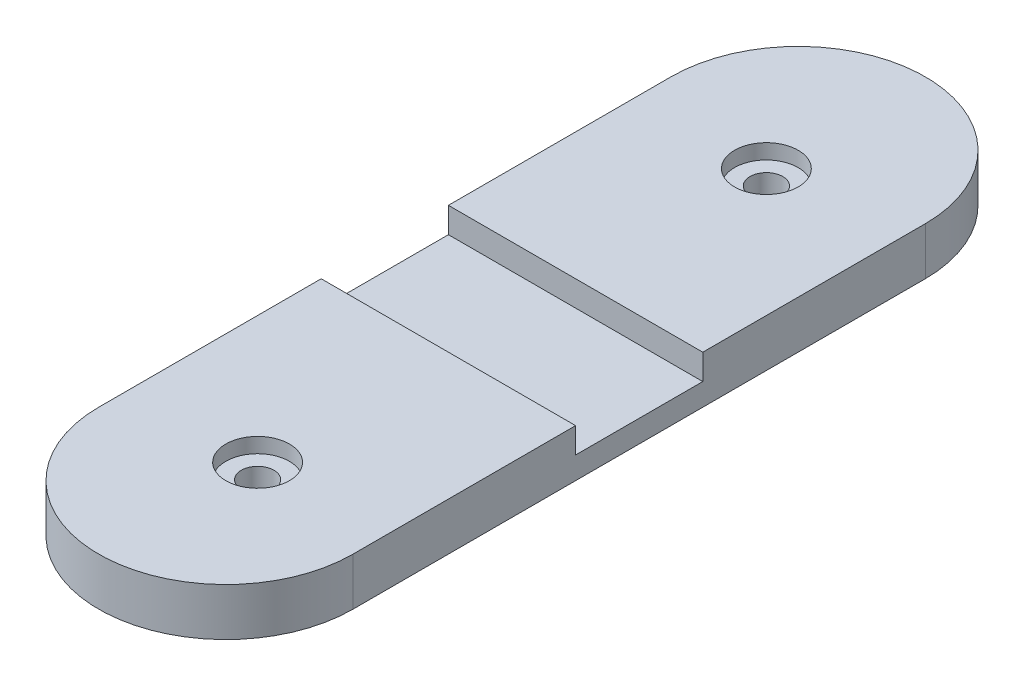
ISO-10303-21;
HEADER;
FILE_DESCRIPTION(('STEP AP214'),'2;1');
FILE_NAME('part.step','',(''),(''),'','','');
FILE_SCHEMA(('AUTOMOTIVE_DESIGN { 1 0 10303 214 1 1 1 1 }'));
ENDSEC;
DATA;
#1=APPLICATION_CONTEXT('core data for automotive mechanical design processes');
#2=APPLICATION_PROTOCOL_DEFINITION('international standard','automotive_design',2000,#1);
#3=PRODUCT_CONTEXT('',#1,'mechanical');
#4=PRODUCT('Part','Part','',(#3));
#5=PRODUCT_RELATED_PRODUCT_CATEGORY('part','',(#4));
#6=PRODUCT_DEFINITION_FORMATION('','',#4);
#7=PRODUCT_DEFINITION_CONTEXT('part definition',#1,'design');
#8=PRODUCT_DEFINITION('design','',#6,#7);
#9=PRODUCT_DEFINITION_SHAPE('','',#8);
#10=(LENGTH_UNIT() NAMED_UNIT(*) SI_UNIT(.MILLI.,.METRE.));
#11=(NAMED_UNIT(*) PLANE_ANGLE_UNIT() SI_UNIT($,.RADIAN.));
#12=(NAMED_UNIT(*) SI_UNIT($,.STERADIAN.) SOLID_ANGLE_UNIT());
#13=UNCERTAINTY_MEASURE_WITH_UNIT(LENGTH_MEASURE(1.E-05),#10,'distance_accuracy_value','');
#14=(GEOMETRIC_REPRESENTATION_CONTEXT(3) GLOBAL_UNCERTAINTY_ASSIGNED_CONTEXT((#13)) GLOBAL_UNIT_ASSIGNED_CONTEXT((#10,
#11,#12)) REPRESENTATION_CONTEXT('',''));
#15=CARTESIAN_POINT('',(0.,0.,0.));
#16=DIRECTION('',(0.,0.,1.));
#17=DIRECTION('',(1.,0.,0.));
#18=AXIS2_PLACEMENT_3D('',#15,#16,#17);
#19=CARTESIAN_POINT('',(0.,4.7625,-28.575));
#20=DIRECTION('',(0.,-1.,0.));
#21=DIRECTION('',(0.,0.,-1.));
#22=AXIS2_PLACEMENT_3D('',#19,#20,#21);
#23=PLANE('',#22);
#24=CARTESIAN_POINT('',(0.,4.7625,-25.4));
#25=DIRECTION('',(0.,1.,0.));
#26=DIRECTION('',(0.,0.,1.));
#27=AXIS2_PLACEMENT_3D('',#24,#25,#26);
#28=CIRCLE('',#27,3.175);
#29=CARTESIAN_POINT('',(0.,4.7625,-22.225));
#30=VERTEX_POINT('',#29);
#31=EDGE_CURVE('E149',#30,#30,#28,.T.);
#32=ORIENTED_EDGE('',*,*,#31,.F.);
#33=EDGE_LOOP('',(#32));
#34=FACE_BOUND('',#33,.T.);
#35=DIRECTION('',(0.,0.,1.));
#36=VECTOR('',#35,1.);
#37=CARTESIAN_POINT('',(-12.7,4.7625,28.575));
#38=LINE('',#37,#36);
#39=CARTESIAN_POINT('',(-12.7,4.7625,-28.575));
#40=VERTEX_POINT('',#39);
#41=CARTESIAN_POINT('',(-12.7,4.7625,-6.35));
#42=VERTEX_POINT('',#41);
#43=EDGE_CURVE('E88',#40,#42,#38,.T.);
#44=ORIENTED_EDGE('',*,*,#43,.T.);
#45=DIRECTION('',(-1.,0.,0.));
#46=VECTOR('',#45,1.);
#47=CARTESIAN_POINT('',(12.7,4.7625,-6.35));
#48=LINE('',#47,#46);
#49=CARTESIAN_POINT('',(12.7,4.7625,-6.35));
#50=VERTEX_POINT('',#49);
#51=EDGE_CURVE('E124',#50,#42,#48,.T.);
#52=ORIENTED_EDGE('',*,*,#51,.F.);
#53=DIRECTION('',(0.,0.,-1.));
#54=VECTOR('',#53,1.);
#55=CARTESIAN_POINT('',(12.7,4.7625,-28.575));
#56=LINE('',#55,#54);
#57=CARTESIAN_POINT('',(12.7,4.7625,-28.575));
#58=VERTEX_POINT('',#57);
#59=EDGE_CURVE('E59',#50,#58,#56,.T.);
#60=ORIENTED_EDGE('',*,*,#59,.T.);
#61=CARTESIAN_POINT('',(0.,4.7625,-28.575));
#62=DIRECTION('',(0.,1.,0.));
#63=DIRECTION('',(0.,0.,-1.));
#64=AXIS2_PLACEMENT_3D('',#61,#62,#63);
#65=CIRCLE('',#64,12.7);
#66=EDGE_CURVE('E162',#58,#40,#65,.T.);
#67=ORIENTED_EDGE('',*,*,#66,.T.);
#68=EDGE_LOOP('',(#44,#52,#60,#67));
#69=FACE_BOUND('',#68,.T.);
#70=ADVANCED_FACE('F35',(#34,#69),#23,.F.);
#71=CARTESIAN_POINT('',(0.,4.7625,-28.575));
#72=DIRECTION('',(0.,-1.,0.));
#73=DIRECTION('',(0.,0.,-1.));
#74=AXIS2_PLACEMENT_3D('',#71,#72,#73);
#75=CYLINDRICAL_SURFACE('',#74,12.7);
#76=CARTESIAN_POINT('',(0.,0.,-28.575));
#77=DIRECTION('',(0.,1.,0.));
#78=DIRECTION('',(0.,0.,-1.));
#79=AXIS2_PLACEMENT_3D('',#76,#77,#78);
#80=CIRCLE('',#79,12.7);
#81=CARTESIAN_POINT('',(12.7,0.,-28.575));
#82=VERTEX_POINT('',#81);
#83=CARTESIAN_POINT('',(-12.7,0.,-28.575));
#84=VERTEX_POINT('',#83);
#85=EDGE_CURVE('E161',#82,#84,#80,.T.);
#86=ORIENTED_EDGE('',*,*,#85,.T.);
#87=DIRECTION('',(0.,-1.,0.));
#88=VECTOR('',#87,1.);
#89=CARTESIAN_POINT('',(-12.7,4.7625,-28.575));
#90=LINE('',#89,#88);
#91=EDGE_CURVE('E11',#40,#84,#90,.T.);
#92=ORIENTED_EDGE('',*,*,#91,.F.);
#93=ORIENTED_EDGE('',*,*,#66,.F.);
#94=DIRECTION('',(0.,-1.,0.));
#95=VECTOR('',#94,1.);
#96=CARTESIAN_POINT('',(12.7,4.7625,-28.575));
#97=LINE('',#96,#95);
#98=EDGE_CURVE('E170',#58,#82,#97,.T.);
#99=ORIENTED_EDGE('',*,*,#98,.T.);
#100=EDGE_LOOP('',(#86,#92,#93,#99));
#101=FACE_BOUND('',#100,.T.);
#102=ADVANCED_FACE('F37',(#101),#75,.T.);
#103=CARTESIAN_POINT('',(-12.7,4.7625,28.575));
#104=DIRECTION('',(1.,0.,0.));
#105=DIRECTION('',(0.,0.,-1.));
#106=AXIS2_PLACEMENT_3D('',#103,#104,#105);
#107=PLANE('',#106);
#108=DIRECTION('',(0.,0.,1.));
#109=VECTOR('',#108,1.);
#110=CARTESIAN_POINT('',(-12.7,2.2225,-6.35));
#111=LINE('',#110,#109);
#112=CARTESIAN_POINT('',(-12.7,2.2225,-6.35));
#113=VERTEX_POINT('',#112);
#114=CARTESIAN_POINT('',(-12.7,2.2225,6.35));
#115=VERTEX_POINT('',#114);
#116=EDGE_CURVE('E117',#113,#115,#111,.T.);
#117=ORIENTED_EDGE('',*,*,#116,.F.);
#118=DIRECTION('',(0.,1.,0.));
#119=VECTOR('',#118,1.);
#120=CARTESIAN_POINT('',(-12.7,2.2225,-6.35));
#121=LINE('',#120,#119);
#122=EDGE_CURVE('E140',#113,#42,#121,.T.);
#123=ORIENTED_EDGE('',*,*,#122,.T.);
#124=ORIENTED_EDGE('',*,*,#43,.F.);
#125=ORIENTED_EDGE('',*,*,#91,.T.);
#126=DIRECTION('',(0.,0.,1.));
#127=VECTOR('',#126,1.);
#128=CARTESIAN_POINT('',(-12.7,0.,28.575));
#129=LINE('',#128,#127);
#130=CARTESIAN_POINT('',(-12.7,0.,28.575));
#131=VERTEX_POINT('',#130);
#132=EDGE_CURVE('E173',#84,#131,#129,.T.);
#133=ORIENTED_EDGE('',*,*,#132,.T.);
#134=DIRECTION('',(0.,-1.,0.));
#135=VECTOR('',#134,1.);
#136=CARTESIAN_POINT('',(-12.7,4.7625,28.575));
#137=LINE('',#136,#135);
#138=CARTESIAN_POINT('',(-12.7,4.7625,28.575));
#139=VERTEX_POINT('',#138);
#140=EDGE_CURVE('E43',#139,#131,#137,.T.);
#141=ORIENTED_EDGE('',*,*,#140,.F.);
#142=CARTESIAN_POINT('',(-12.7,4.7625,6.35));
#143=VERTEX_POINT('',#142);
#144=EDGE_CURVE('E129',#143,#139,#38,.T.);
#145=ORIENTED_EDGE('',*,*,#144,.F.);
#146=DIRECTION('',(0.,1.,0.));
#147=VECTOR('',#146,1.);
#148=CARTESIAN_POINT('',(-12.7,2.2225,6.35));
#149=LINE('',#148,#147);
#150=EDGE_CURVE('E50',#115,#143,#149,.T.);
#151=ORIENTED_EDGE('',*,*,#150,.F.);
#152=EDGE_LOOP('',(#117,#123,#124,#125,#133,#141,#145,#151));
#153=FACE_BOUND('',#152,.T.);
#154=ADVANCED_FACE('F127',(#153),#107,.F.);
#155=CARTESIAN_POINT('',(0.,4.7625,28.575));
#156=DIRECTION('',(0.,-1.,0.));
#157=DIRECTION('',(0.,0.,-1.));
#158=AXIS2_PLACEMENT_3D('',#155,#156,#157);
#159=CYLINDRICAL_SURFACE('',#158,12.7);
#160=CARTESIAN_POINT('',(0.,0.,28.575));
#161=DIRECTION('',(0.,1.,0.));
#162=DIRECTION('',(0.,0.,1.));
#163=AXIS2_PLACEMENT_3D('',#160,#161,#162);
#164=CIRCLE('',#163,12.7);
#165=CARTESIAN_POINT('',(12.7,0.,28.575));
#166=VERTEX_POINT('',#165);
#167=EDGE_CURVE('E175',#131,#166,#164,.T.);
#168=ORIENTED_EDGE('',*,*,#167,.T.);
#169=DIRECTION('',(0.,-1.,0.));
#170=VECTOR('',#169,1.);
#171=CARTESIAN_POINT('',(12.7,4.7625,28.575));
#172=LINE('',#171,#170);
#173=CARTESIAN_POINT('',(12.7,4.7625,28.575));
#174=VERTEX_POINT('',#173);
#175=EDGE_CURVE('E179',#174,#166,#172,.T.);
#176=ORIENTED_EDGE('',*,*,#175,.F.);
#177=CARTESIAN_POINT('',(0.,4.7625,28.575));
#178=DIRECTION('',(0.,1.,0.));
#179=DIRECTION('',(0.,0.,1.));
#180=AXIS2_PLACEMENT_3D('',#177,#178,#179);
#181=CIRCLE('',#180,12.7);
#182=EDGE_CURVE('E165',#139,#174,#181,.T.);
#183=ORIENTED_EDGE('',*,*,#182,.F.);
#184=ORIENTED_EDGE('',*,*,#140,.T.);
#185=EDGE_LOOP('',(#168,#176,#183,#184));
#186=FACE_BOUND('',#185,.T.);
#187=ADVANCED_FACE('F184',(#186),#159,.T.);
#188=CARTESIAN_POINT('',(12.7,4.7625,-28.575));
#189=DIRECTION('',(-1.,0.,0.));
#190=DIRECTION('',(0.,0.,1.));
#191=AXIS2_PLACEMENT_3D('',#188,#189,#190);
#192=PLANE('',#191);
#193=ORIENTED_EDGE('',*,*,#59,.F.);
#194=DIRECTION('',(0.,1.,0.));
#195=VECTOR('',#194,1.);
#196=CARTESIAN_POINT('',(12.7,2.2225,-6.35));
#197=LINE('',#196,#195);
#198=CARTESIAN_POINT('',(12.7,2.2225,-6.35));
#199=VERTEX_POINT('',#198);
#200=EDGE_CURVE('E131',#199,#50,#197,.T.);
#201=ORIENTED_EDGE('',*,*,#200,.F.);
#202=DIRECTION('',(0.,0.,-1.));
#203=VECTOR('',#202,1.);
#204=CARTESIAN_POINT('',(12.7,2.2225,-6.35));
#205=LINE('',#204,#203);
#206=CARTESIAN_POINT('',(12.7,2.2225,6.35));
#207=VERTEX_POINT('',#206);
#208=EDGE_CURVE('E116',#207,#199,#205,.T.);
#209=ORIENTED_EDGE('',*,*,#208,.F.);
#210=DIRECTION('',(0.,1.,0.));
#211=VECTOR('',#210,1.);
#212=CARTESIAN_POINT('',(12.7,2.2225,6.35));
#213=LINE('',#212,#211);
#214=CARTESIAN_POINT('',(12.7,4.7625,6.35));
#215=VERTEX_POINT('',#214);
#216=EDGE_CURVE('E113',#207,#215,#213,.T.);
#217=ORIENTED_EDGE('',*,*,#216,.T.);
#218=EDGE_CURVE('E167',#174,#215,#56,.T.);
#219=ORIENTED_EDGE('',*,*,#218,.F.);
#220=ORIENTED_EDGE('',*,*,#175,.T.);
#221=DIRECTION('',(0.,0.,-1.));
#222=VECTOR('',#221,1.);
#223=CARTESIAN_POINT('',(12.7,0.,-28.575));
#224=LINE('',#223,#222);
#225=EDGE_CURVE('E81',#166,#82,#224,.T.);
#226=ORIENTED_EDGE('',*,*,#225,.T.);
#227=ORIENTED_EDGE('',*,*,#98,.F.);
#228=EDGE_LOOP('',(#193,#201,#209,#217,#219,#220,#226,#227));
#229=FACE_BOUND('',#228,.T.);
#230=ADVANCED_FACE('F192',(#229),#192,.F.);
#231=CARTESIAN_POINT('',(0.,4.7625,25.4));
#232=DIRECTION('',(0.,1.,0.));
#233=DIRECTION('',(0.,0.,1.));
#234=AXIS2_PLACEMENT_3D('',#231,#232,#233);
#235=CIRCLE('',#234,3.175);
#236=CARTESIAN_POINT('',(0.,4.7625,28.575));
#237=VERTEX_POINT('',#236);
#238=EDGE_CURVE('E136',#237,#237,#235,.T.);
#239=ORIENTED_EDGE('',*,*,#238,.F.);
#240=EDGE_LOOP('',(#239));
#241=FACE_BOUND('',#240,.T.);
#242=ORIENTED_EDGE('',*,*,#218,.T.);
#243=DIRECTION('',(1.,0.,0.));
#244=VECTOR('',#243,1.);
#245=CARTESIAN_POINT('',(12.7,4.7625,6.35));
#246=LINE('',#245,#244);
#247=EDGE_CURVE('E198',#143,#215,#246,.T.);
#248=ORIENTED_EDGE('',*,*,#247,.F.);
#249=ORIENTED_EDGE('',*,*,#144,.T.);
#250=ORIENTED_EDGE('',*,*,#182,.T.);
#251=EDGE_LOOP('',(#242,#248,#249,#250));
#252=FACE_BOUND('',#251,.T.);
#253=ADVANCED_FACE('F204',(#241,#252),#23,.F.);
#254=CARTESIAN_POINT('',(0.,0.,-28.575));
#255=DIRECTION('',(0.,-1.,0.));
#256=DIRECTION('',(0.,0.,-1.));
#257=AXIS2_PLACEMENT_3D('',#254,#255,#256);
#258=PLANE('',#257);
#259=CARTESIAN_POINT('',(0.,0.,25.4));
#260=DIRECTION('',(0.,1.,0.));
#261=DIRECTION('',(0.,0.,1.));
#262=AXIS2_PLACEMENT_3D('',#259,#260,#261);
#263=CIRCLE('',#262,1.63195);
#264=CARTESIAN_POINT('',(0.,0.,27.03195));
#265=VERTEX_POINT('',#264);
#266=EDGE_CURVE('E146',#265,#265,#263,.T.);
#267=ORIENTED_EDGE('',*,*,#266,.T.);
#268=EDGE_LOOP('',(#267));
#269=FACE_BOUND('',#268,.T.);
#270=CARTESIAN_POINT('',(0.,0.,-25.4));
#271=DIRECTION('',(0.,1.,0.));
#272=DIRECTION('',(0.,0.,1.));
#273=AXIS2_PLACEMENT_3D('',#270,#271,#272);
#274=CIRCLE('',#273,1.63195);
#275=CARTESIAN_POINT('',(0.,0.,-23.76805));
#276=VERTEX_POINT('',#275);
#277=EDGE_CURVE('E158',#276,#276,#274,.T.);
#278=ORIENTED_EDGE('',*,*,#277,.T.);
#279=EDGE_LOOP('',(#278));
#280=FACE_BOUND('',#279,.T.);
#281=ORIENTED_EDGE('',*,*,#85,.F.);
#282=ORIENTED_EDGE('',*,*,#225,.F.);
#283=ORIENTED_EDGE('',*,*,#167,.F.);
#284=ORIENTED_EDGE('',*,*,#132,.F.);
#285=EDGE_LOOP('',(#281,#282,#283,#284));
#286=FACE_BOUND('',#285,.T.);
#287=ADVANCED_FACE('F188',(#269,#280,#286),#258,.T.);
#288=CARTESIAN_POINT('',(0.,4.7625,-25.4));
#289=DIRECTION('',(0.,1.,0.));
#290=DIRECTION('',(0.,0.,1.));
#291=AXIS2_PLACEMENT_3D('',#288,#289,#290);
#292=CYLINDRICAL_SURFACE('',#291,1.63195);
#293=ORIENTED_EDGE('',*,*,#277,.F.);
#294=EDGE_LOOP('',(#293));
#295=FACE_BOUND('',#294,.T.);
#296=CARTESIAN_POINT('',(0.,3.2639,-25.4));
#297=DIRECTION('',(0.,1.,0.));
#298=DIRECTION('',(0.,0.,1.));
#299=AXIS2_PLACEMENT_3D('',#296,#297,#298);
#300=CIRCLE('',#299,1.63195);
#301=CARTESIAN_POINT('',(0.,3.2639,-23.76805));
#302=VERTEX_POINT('',#301);
#303=EDGE_CURVE('E155',#302,#302,#300,.T.);
#304=ORIENTED_EDGE('',*,*,#303,.T.);
#305=EDGE_LOOP('',(#304));
#306=FACE_BOUND('',#305,.T.);
#307=ADVANCED_FACE('F217',(#295,#306),#292,.F.);
#308=CARTESIAN_POINT('',(1.63195,3.2639,-25.4));
#309=DIRECTION('',(0.,-1.,0.));
#310=DIRECTION('',(0.,0.,-1.));
#311=AXIS2_PLACEMENT_3D('',#308,#309,#310);
#312=PLANE('',#311);
#313=ORIENTED_EDGE('',*,*,#303,.F.);
#314=EDGE_LOOP('',(#313));
#315=FACE_BOUND('',#314,.T.);
#316=CARTESIAN_POINT('',(0.,3.2639,-25.4));
#317=DIRECTION('',(0.,1.,0.));
#318=DIRECTION('',(0.,0.,1.));
#319=AXIS2_PLACEMENT_3D('',#316,#317,#318);
#320=CIRCLE('',#319,3.175);
#321=CARTESIAN_POINT('',(0.,3.2639,-22.225));
#322=VERTEX_POINT('',#321);
#323=EDGE_CURVE('E152',#322,#322,#320,.T.);
#324=ORIENTED_EDGE('',*,*,#323,.T.);
#325=EDGE_LOOP('',(#324));
#326=FACE_BOUND('',#325,.T.);
#327=ADVANCED_FACE('F246',(#315,#326),#312,.F.);
#328=CARTESIAN_POINT('',(0.,4.7625,-25.4));
#329=DIRECTION('',(0.,1.,0.));
#330=DIRECTION('',(0.,0.,1.));
#331=AXIS2_PLACEMENT_3D('',#328,#329,#330);
#332=CYLINDRICAL_SURFACE('',#331,3.175);
#333=ORIENTED_EDGE('',*,*,#323,.F.);
#334=EDGE_LOOP('',(#333));
#335=FACE_BOUND('',#334,.T.);
#336=ORIENTED_EDGE('',*,*,#31,.T.);
#337=EDGE_LOOP('',(#336));
#338=FACE_BOUND('',#337,.T.);
#339=ADVANCED_FACE('F242',(#335,#338),#332,.F.);
#340=CARTESIAN_POINT('',(0.,4.7625,25.4));
#341=DIRECTION('',(0.,1.,0.));
#342=DIRECTION('',(0.,0.,1.));
#343=AXIS2_PLACEMENT_3D('',#340,#341,#342);
#344=CYLINDRICAL_SURFACE('',#343,1.63195);
#345=ORIENTED_EDGE('',*,*,#266,.F.);
#346=EDGE_LOOP('',(#345));
#347=FACE_BOUND('',#346,.T.);
#348=CARTESIAN_POINT('',(0.,3.2639,25.4));
#349=DIRECTION('',(0.,1.,0.));
#350=DIRECTION('',(0.,0.,1.));
#351=AXIS2_PLACEMENT_3D('',#348,#349,#350);
#352=CIRCLE('',#351,1.63195);
#353=CARTESIAN_POINT('',(0.,3.2639,27.03195));
#354=VERTEX_POINT('',#353);
#355=EDGE_CURVE('E143',#354,#354,#352,.T.);
#356=ORIENTED_EDGE('',*,*,#355,.T.);
#357=EDGE_LOOP('',(#356));
#358=FACE_BOUND('',#357,.T.);
#359=ADVANCED_FACE('F234',(#347,#358),#344,.F.);
#360=CARTESIAN_POINT('',(1.63195,3.2639,25.4));
#361=DIRECTION('',(0.,-1.,0.));
#362=DIRECTION('',(0.,0.,-1.));
#363=AXIS2_PLACEMENT_3D('',#360,#361,#362);
#364=PLANE('',#363);
#365=ORIENTED_EDGE('',*,*,#355,.F.);
#366=EDGE_LOOP('',(#365));
#367=FACE_BOUND('',#366,.T.);
#368=CARTESIAN_POINT('',(0.,3.2639,25.4));
#369=DIRECTION('',(0.,1.,0.));
#370=DIRECTION('',(0.,0.,1.));
#371=AXIS2_PLACEMENT_3D('',#368,#369,#370);
#372=CIRCLE('',#371,3.175);
#373=CARTESIAN_POINT('',(0.,3.2639,28.575));
#374=VERTEX_POINT('',#373);
#375=EDGE_CURVE('E139',#374,#374,#372,.T.);
#376=ORIENTED_EDGE('',*,*,#375,.T.);
#377=EDGE_LOOP('',(#376));
#378=FACE_BOUND('',#377,.T.);
#379=ADVANCED_FACE('F226',(#367,#378),#364,.F.);
#380=CARTESIAN_POINT('',(0.,4.7625,25.4));
#381=DIRECTION('',(0.,1.,0.));
#382=DIRECTION('',(0.,0.,1.));
#383=AXIS2_PLACEMENT_3D('',#380,#381,#382);
#384=CYLINDRICAL_SURFACE('',#383,3.175);
#385=ORIENTED_EDGE('',*,*,#375,.F.);
#386=EDGE_LOOP('',(#385));
#387=FACE_BOUND('',#386,.T.);
#388=ORIENTED_EDGE('',*,*,#238,.T.);
#389=EDGE_LOOP('',(#388));
#390=FACE_BOUND('',#389,.T.);
#391=ADVANCED_FACE('F224',(#387,#390),#384,.F.);
#392=CARTESIAN_POINT('',(12.7,2.2225,-6.35));
#393=DIRECTION('',(0.,0.,-1.));
#394=DIRECTION('',(-1.,0.,0.));
#395=AXIS2_PLACEMENT_3D('',#392,#393,#394);
#396=PLANE('',#395);
#397=ORIENTED_EDGE('',*,*,#51,.T.);
#398=ORIENTED_EDGE('',*,*,#122,.F.);
#399=DIRECTION('',(-1.,0.,0.));
#400=VECTOR('',#399,1.);
#401=CARTESIAN_POINT('',(12.7,2.2225,-6.35));
#402=LINE('',#401,#400);
#403=EDGE_CURVE('E123',#199,#113,#402,.T.);
#404=ORIENTED_EDGE('',*,*,#403,.F.);
#405=ORIENTED_EDGE('',*,*,#200,.T.);
#406=EDGE_LOOP('',(#397,#398,#404,#405));
#407=FACE_BOUND('',#406,.T.);
#408=ADVANCED_FACE('F200',(#407),#396,.F.);
#409=CARTESIAN_POINT('',(12.7,2.2225,6.35));
#410=DIRECTION('',(0.,0.,1.));
#411=DIRECTION('',(1.,0.,0.));
#412=AXIS2_PLACEMENT_3D('',#409,#410,#411);
#413=PLANE('',#412);
#414=ORIENTED_EDGE('',*,*,#247,.T.);
#415=ORIENTED_EDGE('',*,*,#216,.F.);
#416=DIRECTION('',(1.,0.,0.));
#417=VECTOR('',#416,1.);
#418=CARTESIAN_POINT('',(12.7,2.2225,6.35));
#419=LINE('',#418,#417);
#420=EDGE_CURVE('E109',#115,#207,#419,.T.);
#421=ORIENTED_EDGE('',*,*,#420,.F.);
#422=ORIENTED_EDGE('',*,*,#150,.T.);
#423=EDGE_LOOP('',(#414,#415,#421,#422));
#424=FACE_BOUND('',#423,.T.);
#425=ADVANCED_FACE('F111',(#424),#413,.F.);
#426=CARTESIAN_POINT('',(-12.7,2.2225,6.35));
#427=DIRECTION('',(0.,-1.,0.));
#428=DIRECTION('',(0.,0.,-1.));
#429=AXIS2_PLACEMENT_3D('',#426,#427,#428);
#430=PLANE('',#429);
#431=ORIENTED_EDGE('',*,*,#116,.T.);
#432=ORIENTED_EDGE('',*,*,#420,.T.);
#433=ORIENTED_EDGE('',*,*,#208,.T.);
#434=ORIENTED_EDGE('',*,*,#403,.T.);
#435=EDGE_LOOP('',(#431,#432,#433,#434));
#436=FACE_BOUND('',#435,.T.);
#437=ADVANCED_FACE('F121',(#436),#430,.F.);
#438=CLOSED_SHELL('',(#70,#102,#154,#187,#230,#253,#287,#307,#327,#339,#359,#379,#391,#408,#425,#437));
#439=MANIFOLD_SOLID_BREP('B2',#438);
#440=ADVANCED_BREP_SHAPE_REPRESENTATION('',(#18,#439),#14);
#441=SHAPE_DEFINITION_REPRESENTATION(#9,#440);
ENDSEC;
END-ISO-10303-21;
